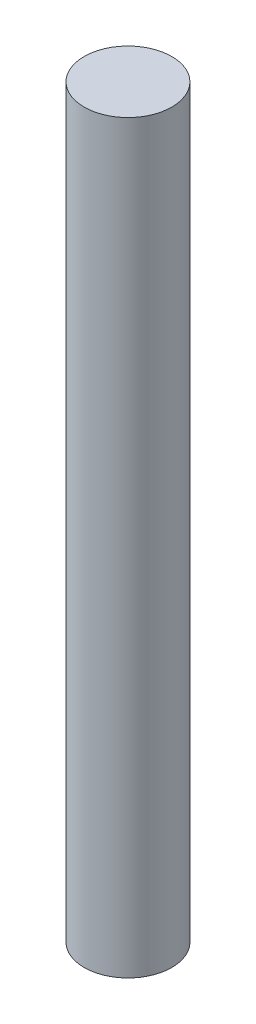
ISO-10303-21;
HEADER;
FILE_DESCRIPTION(('STEP AP214'),'2;1');
FILE_NAME('part.step','',(''),(''),'','','');
FILE_SCHEMA(('AUTOMOTIVE_DESIGN { 1 0 10303 214 1 1 1 1 }'));
ENDSEC;
DATA;
#1=APPLICATION_CONTEXT('core data for automotive mechanical design processes');
#2=APPLICATION_PROTOCOL_DEFINITION('international standard','automotive_design',2000,#1);
#3=PRODUCT_CONTEXT('',#1,'mechanical');
#4=PRODUCT('Part','Part','',(#3));
#5=PRODUCT_RELATED_PRODUCT_CATEGORY('part','',(#4));
#6=PRODUCT_DEFINITION_FORMATION('','',#4);
#7=PRODUCT_DEFINITION_CONTEXT('part definition',#1,'design');
#8=PRODUCT_DEFINITION('design','',#6,#7);
#9=PRODUCT_DEFINITION_SHAPE('','',#8);
#10=(LENGTH_UNIT() NAMED_UNIT(*) SI_UNIT(.MILLI.,.METRE.));
#11=(NAMED_UNIT(*) PLANE_ANGLE_UNIT() SI_UNIT($,.RADIAN.));
#12=(NAMED_UNIT(*) SI_UNIT($,.STERADIAN.) SOLID_ANGLE_UNIT());
#13=UNCERTAINTY_MEASURE_WITH_UNIT(LENGTH_MEASURE(1.E-05),#10,'distance_accuracy_value','');
#14=(GEOMETRIC_REPRESENTATION_CONTEXT(3) GLOBAL_UNCERTAINTY_ASSIGNED_CONTEXT((#13)) GLOBAL_UNIT_ASSIGNED_CONTEXT((#10,
#11,#12)) REPRESENTATION_CONTEXT('',''));
#15=CARTESIAN_POINT('',(0.,0.,0.));
#16=DIRECTION('',(0.,0.,1.));
#17=DIRECTION('',(1.,0.,0.));
#18=AXIS2_PLACEMENT_3D('',#15,#16,#17);
#19=CARTESIAN_POINT('',(0.,34.,0.));
#20=DIRECTION('',(0.,-1.,0.));
#21=DIRECTION('',(0.,0.,-1.));
#22=AXIS2_PLACEMENT_3D('',#19,#20,#21);
#23=CYLINDRICAL_SURFACE('',#22,2.);
#24=CARTESIAN_POINT('',(0.,34.,0.));
#25=DIRECTION('',(0.,1.,0.));
#26=DIRECTION('',(0.,0.,1.));
#27=AXIS2_PLACEMENT_3D('',#24,#25,#26);
#28=CIRCLE('',#27,2.);
#29=CARTESIAN_POINT('',(0.,34.,2.));
#30=VERTEX_POINT('',#29);
#31=EDGE_CURVE('E10',#30,#30,#28,.T.);
#32=ORIENTED_EDGE('',*,*,#31,.F.);
#33=EDGE_LOOP('',(#32));
#34=FACE_BOUND('',#33,.T.);
#35=CARTESIAN_POINT('',(0.,0.,0.));
#36=DIRECTION('',(0.,1.,0.));
#37=DIRECTION('',(0.,0.,1.));
#38=AXIS2_PLACEMENT_3D('',#35,#36,#37);
#39=CIRCLE('',#38,2.);
#40=CARTESIAN_POINT('',(0.,0.,2.));
#41=VERTEX_POINT('',#40);
#42=EDGE_CURVE('E36',#41,#41,#39,.T.);
#43=ORIENTED_EDGE('',*,*,#42,.T.);
#44=EDGE_LOOP('',(#43));
#45=FACE_BOUND('',#44,.T.);
#46=ADVANCED_FACE('F33',(#34,#45),#23,.T.);
#47=CARTESIAN_POINT('',(0.,34.,0.));
#48=DIRECTION('',(0.,1.,0.));
#49=DIRECTION('',(0.,0.,1.));
#50=AXIS2_PLACEMENT_3D('',#47,#48,#49);
#51=PLANE('',#50);
#52=ORIENTED_EDGE('',*,*,#31,.T.);
#53=EDGE_LOOP('',(#52));
#54=FACE_BOUND('',#53,.T.);
#55=ADVANCED_FACE('F48',(#54),#51,.T.);
#56=CARTESIAN_POINT('',(0.,0.,0.));
#57=DIRECTION('',(0.,1.,0.));
#58=DIRECTION('',(0.,0.,1.));
#59=AXIS2_PLACEMENT_3D('',#56,#57,#58);
#60=PLANE('',#59);
#61=ORIENTED_EDGE('',*,*,#42,.F.);
#62=EDGE_LOOP('',(#61));
#63=FACE_BOUND('',#62,.T.);
#64=ADVANCED_FACE('F46',(#63),#60,.F.);
#65=CLOSED_SHELL('',(#46,#55,#64));
#66=MANIFOLD_SOLID_BREP('B2',#65);
#67=ADVANCED_BREP_SHAPE_REPRESENTATION('',(#18,#66),#14);
#68=SHAPE_DEFINITION_REPRESENTATION(#9,#67);
ENDSEC;
END-ISO-10303-21;
